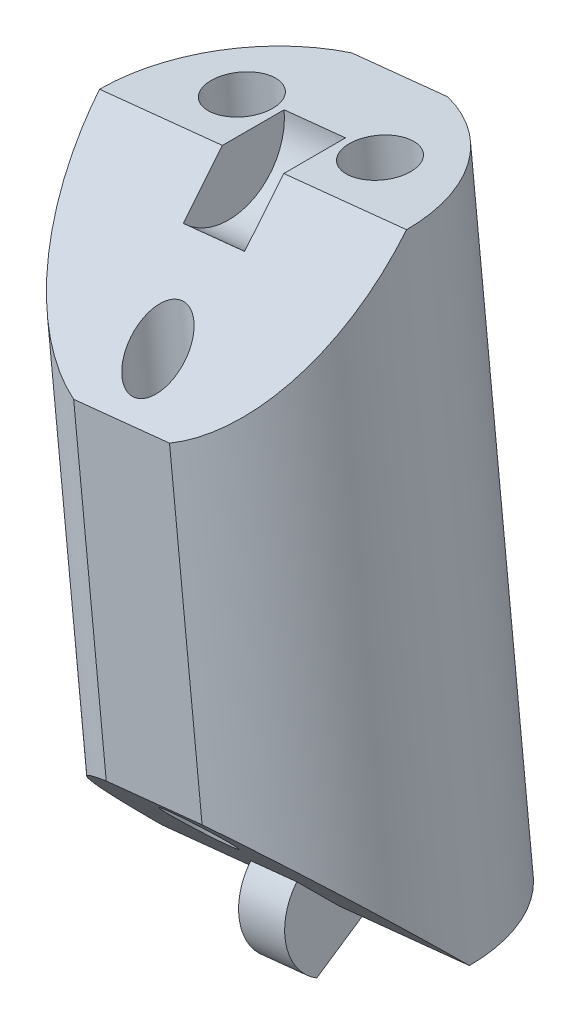
ISO-10303-21;
HEADER;
FILE_DESCRIPTION(('STEP AP214'),'2;1');
FILE_NAME('part.step','',(''),(''),'','','');
FILE_SCHEMA(('AUTOMOTIVE_DESIGN { 1 0 10303 214 1 1 1 1 }'));
ENDSEC;
DATA;
#1=APPLICATION_CONTEXT('core data for automotive mechanical design processes');
#2=APPLICATION_PROTOCOL_DEFINITION('international standard','automotive_design',2000,#1);
#3=PRODUCT_CONTEXT('',#1,'mechanical');
#4=PRODUCT('Part','Part','',(#3));
#5=PRODUCT_RELATED_PRODUCT_CATEGORY('part','',(#4));
#6=PRODUCT_DEFINITION_FORMATION('','',#4);
#7=PRODUCT_DEFINITION_CONTEXT('part definition',#1,'design');
#8=PRODUCT_DEFINITION('design','',#6,#7);
#9=PRODUCT_DEFINITION_SHAPE('','',#8);
#10=(LENGTH_UNIT() NAMED_UNIT(*) SI_UNIT(.MILLI.,.METRE.));
#11=(NAMED_UNIT(*) PLANE_ANGLE_UNIT() SI_UNIT($,.RADIAN.));
#12=(NAMED_UNIT(*) SI_UNIT($,.STERADIAN.) SOLID_ANGLE_UNIT());
#13=UNCERTAINTY_MEASURE_WITH_UNIT(LENGTH_MEASURE(1.E-05),#10,'distance_accuracy_value','');
#14=(GEOMETRIC_REPRESENTATION_CONTEXT(3) GLOBAL_UNCERTAINTY_ASSIGNED_CONTEXT((#13)) GLOBAL_UNIT_ASSIGNED_CONTEXT((#10,
#11,#12)) REPRESENTATION_CONTEXT('',''));
#15=CARTESIAN_POINT('',(0.,0.,0.));
#16=DIRECTION('',(0.,0.,1.));
#17=DIRECTION('',(1.,0.,0.));
#18=AXIS2_PLACEMENT_3D('',#15,#16,#17);
#19=CARTESIAN_POINT('',(-6.71132089996968,165.844299887328,0.));
#20=DIRECTION('',(-0.103150523023817,0.994665757729657,0.));
#21=DIRECTION('',(-0.994665757729657,-0.103150523023817,0.));
#22=AXIS2_PLACEMENT_3D('',#19,#20,#21);
#23=CYLINDRICAL_SURFACE('',#22,8.);
#24=CARTESIAN_POINT('',(-6.71132089996968,165.844299887328,0.));
#25=DIRECTION('',(0.103150523023817,-0.994665757729657,0.));
#26=DIRECTION('',(0.994665757729657,0.103150523023817,0.));
#27=AXIS2_PLACEMENT_3D('',#24,#25,#26);
#28=CIRCLE('',#27,8.);
#29=CARTESIAN_POINT('',(-4.22664663353082,166.101969811255,-7.6));
#30=VERTEX_POINT('',#29);
#31=CARTESIAN_POINT('',(1.24600516186757,166.669504071519,0.));
#32=VERTEX_POINT('',#31);
#33=EDGE_CURVE('E156',#30,#32,#28,.T.);
#34=ORIENTED_EDGE('',*,*,#33,.F.);
#35=DIRECTION('',(-0.103150523023817,0.994665757729657,0.));
#36=VECTOR('',#35,1.);
#37=CARTESIAN_POINT('',(-4.22664663353082,166.101969811255,-7.6));
#38=LINE('',#37,#36);
#39=CARTESIAN_POINT('',(-7.48403157112503,197.512467423771,-7.6));
#40=VERTEX_POINT('',#39);
#41=EDGE_CURVE('E11',#30,#40,#38,.T.);
#42=ORIENTED_EDGE('',*,*,#41,.T.);
#43=CARTESIAN_POINT('',(-9.9687058375639,197.254797499844,0.));
#44=DIRECTION('',(0.103150523023817,-0.994665757729657,0.));
#45=DIRECTION('',(0.994665757729657,0.103150523023817,0.));
#46=AXIS2_PLACEMENT_3D('',#43,#44,#45);
#47=CIRCLE('',#46,8.);
#48=CARTESIAN_POINT('',(-2.01137977572664,198.080001684034,0.));
#49=VERTEX_POINT('',#48);
#50=EDGE_CURVE('E148',#40,#49,#47,.T.);
#51=ORIENTED_EDGE('',*,*,#50,.T.);
#52=CARTESIAN_POINT('',(-9.9687058375639,197.254797499844,0.));
#53=DIRECTION('',(0.0729384343130803,-0.703334902304699,-0.707106781186544));
#54=DIRECTION('',(-0.0729384343130796,0.703334902304693,-0.707106781186551));
#55=AXIS2_PLACEMENT_3D('',#52,#53,#54);
#56=ELLIPSE('',#55,11.3137084989847,8.);
#57=CARTESIAN_POINT('',(-6.70008759614404,189.953007665026,7.6));
#58=VERTEX_POINT('',#57);
#59=EDGE_CURVE('E202',#49,#58,#56,.T.);
#60=ORIENTED_EDGE('',*,*,#59,.T.);
#61=DIRECTION('',(-0.103150523023817,0.994665757729657,0.));
#62=VECTOR('',#61,1.);
#63=CARTESIAN_POINT('',(-4.22664663353082,166.101969811255,7.6));
#64=LINE('',#63,#62);
#65=CARTESIAN_POINT('',(-5.01059060851183,173.661429570001,7.6));
#66=VERTEX_POINT('',#65);
#67=EDGE_CURVE('E174',#58,#66,#64,.F.);
#68=ORIENTED_EDGE('',*,*,#67,.T.);
#69=CARTESIAN_POINT('',(-6.71132089996969,165.844299887328,0.));
#70=DIRECTION('',(-0.0729384343130803,0.7033349023047,-0.707106781186543));
#71=DIRECTION('',(-0.0729384343130795,0.703334902304692,0.707106781186552));
#72=AXIS2_PLACEMENT_3D('',#69,#70,#71);
#73=ELLIPSE('',#72,11.3137084989847,8.);
#74=EDGE_CURVE('E207',#66,#32,#73,.T.);
#75=ORIENTED_EDGE('',*,*,#74,.T.);
#76=EDGE_LOOP('',(#34,#42,#51,#60,#68,#75));
#77=FACE_BOUND('',#76,.T.);
#78=ADVANCED_FACE('F39',(#77),#23,.T.);
#79=CARTESIAN_POINT('',(-9.9687058375639,197.254797499844,0.));
#80=DIRECTION('',(0.103150523023817,-0.994665757729657,0.));
#81=DIRECTION('',(0.994665757729657,0.103150523023817,0.));
#82=AXIS2_PLACEMENT_3D('',#79,#80,#81);
#83=PLANE('',#82);
#84=CARTESIAN_POINT('',(-13.5495025653907,196.883455616958,-3.));
#85=DIRECTION('',(0.103150523023817,-0.994665757729657,0.));
#86=DIRECTION('',(0.994665757729657,0.103150523023817,0.));
#87=AXIS2_PLACEMENT_3D('',#84,#85,#86);
#88=CIRCLE('',#87,1.6);
#89=CARTESIAN_POINT('',(-11.9580373530232,197.048496453796,-3.));
#90=VERTEX_POINT('',#89);
#91=EDGE_CURVE('E189',#90,#90,#88,.T.);
#92=ORIENTED_EDGE('',*,*,#91,.T.);
#93=EDGE_LOOP('',(#92));
#94=FACE_BOUND('',#93,.T.);
#95=CARTESIAN_POINT('',(-6.38790910973713,197.62613938273,-3.));
#96=DIRECTION('',(0.103150523023817,-0.994665757729657,0.));
#97=DIRECTION('',(0.994665757729657,0.103150523023817,0.));
#98=AXIS2_PLACEMENT_3D('',#95,#96,#97);
#99=CIRCLE('',#98,1.6);
#100=CARTESIAN_POINT('',(-4.79644389736968,197.791180219568,-3.));
#101=VERTEX_POINT('',#100);
#102=EDGE_CURVE('E184',#101,#101,#99,.T.);
#103=ORIENTED_EDGE('',*,*,#102,.T.);
#104=EDGE_LOOP('',(#103));
#105=FACE_BOUND('',#104,.T.);
#106=ORIENTED_EDGE('',*,*,#50,.F.);
#107=DIRECTION('',(0.994665757729657,0.103150523023816,0.));
#108=VECTOR('',#107,1.);
#109=CARTESIAN_POINT('',(-12.4533801040028,196.997127575917,-7.6));
#110=LINE('',#109,#108);
#111=CARTESIAN_POINT('',(-12.4533801040028,196.997127575917,-7.6));
#112=VERTEX_POINT('',#111);
#113=EDGE_CURVE('E134',#112,#40,#110,.T.);
#114=ORIENTED_EDGE('',*,*,#113,.F.);
#115=CARTESIAN_POINT('',(-17.9260318994012,196.429593315653,0.));
#116=VERTEX_POINT('',#115);
#117=EDGE_CURVE('E146',#116,#112,#47,.T.);
#118=ORIENTED_EDGE('',*,*,#117,.F.);
#119=DIRECTION('',(0.994665757729657,0.103150523023817,0.));
#120=VECTOR('',#119,1.);
#121=CARTESIAN_POINT('',(-9.9687058375639,197.254797499844,0.));
#122=LINE('',#121,#120);
#123=CARTESIAN_POINT('',(-11.5601710499314,197.089756663006,0.));
#124=VERTEX_POINT('',#123);
#125=EDGE_CURVE('E165',#116,#124,#122,.T.);
#126=ORIENTED_EDGE('',*,*,#125,.T.);
#127=DIRECTION('',(0.,0.,-1.));
#128=VECTOR('',#127,1.);
#129=CARTESIAN_POINT('',(-11.5601710499314,197.089756663006,0.));
#130=LINE('',#129,#128);
#131=CARTESIAN_POINT('',(-11.5601710499314,197.089756663006,-3.2));
#132=VERTEX_POINT('',#131);
#133=EDGE_CURVE('E256',#124,#132,#130,.T.);
#134=ORIENTED_EDGE('',*,*,#133,.T.);
#135=DIRECTION('',(-0.994665757729657,-0.103150523023817,0.));
#136=VECTOR('',#135,1.);
#137=CARTESIAN_POINT('',(-8.37724062519646,197.419838336682,-3.2));
#138=LINE('',#137,#136);
#139=CARTESIAN_POINT('',(-8.37724062519646,197.419838336682,-3.2));
#140=VERTEX_POINT('',#139);
#141=EDGE_CURVE('E269',#140,#132,#138,.T.);
#142=ORIENTED_EDGE('',*,*,#141,.F.);
#143=DIRECTION('',(0.,0.,-1.));
#144=VECTOR('',#143,1.);
#145=CARTESIAN_POINT('',(-8.37724062519647,197.419838336682,0.));
#146=LINE('',#145,#144);
#147=CARTESIAN_POINT('',(-8.37724062519647,197.419838336682,0.));
#148=VERTEX_POINT('',#147);
#149=EDGE_CURVE('E257',#148,#140,#146,.T.);
#150=ORIENTED_EDGE('',*,*,#149,.F.);
#151=EDGE_CURVE('E169',#148,#49,#122,.T.);
#152=ORIENTED_EDGE('',*,*,#151,.T.);
#153=EDGE_LOOP('',(#106,#114,#118,#126,#134,#142,#150,#152));
#154=FACE_BOUND('',#153,.T.);
#155=ADVANCED_FACE('F144',(#94,#105,#154),#83,.F.);
#156=CARTESIAN_POINT('',(1.21134648710678,198.414210333514,0.));
#157=DIRECTION('',(0.0729384343130803,-0.703334902304699,-0.707106781186544));
#158=DIRECTION('',(0.,0.708995228875745,-0.705213276556411));
#159=AXIS2_PLACEMENT_3D('',#156,#157,#158);
#160=PLANE('',#159);
#161=CARTESIAN_POINT('',(-9.40137796093291,191.784135832331,5.5));
#162=DIRECTION('',(0.0729384343130803,-0.703334902304699,-0.707106781186544));
#163=DIRECTION('',(-0.0729384343130797,0.703334902304693,-0.707106781186551));
#164=AXIS2_PLACEMENT_3D('',#161,#162,#163);
#165=ELLIPSE('',#164,1.97989898732232,1.4);
#166=CARTESIAN_POINT('',(-9.54578869316626,193.176667893152,4.1));
#167=VERTEX_POINT('',#166);
#168=EDGE_CURVE('E179',#167,#167,#165,.T.);
#169=ORIENTED_EDGE('',*,*,#168,.T.);
#170=EDGE_LOOP('',(#169));
#171=FACE_BOUND('',#170,.T.);
#172=CARTESIAN_POINT('',(-11.6694361290218,189.437667817172,7.6));
#173=VERTEX_POINT('',#172);
#174=EDGE_CURVE('E153',#173,#116,#56,.T.);
#175=ORIENTED_EDGE('',*,*,#174,.F.);
#176=DIRECTION('',(0.994665757729657,0.103150523023817,0.));
#177=VECTOR('',#176,1.);
#178=CARTESIAN_POINT('',(1.99529046208778,190.854750574768,7.6));
#179=LINE('',#178,#177);
#180=EDGE_CURVE('E198',#173,#58,#179,.T.);
#181=ORIENTED_EDGE('',*,*,#180,.T.);
#182=ORIENTED_EDGE('',*,*,#59,.F.);
#183=ORIENTED_EDGE('',*,*,#151,.F.);
#184=DIRECTION('',(-0.0729384343130776,0.703334902304677,-0.707106781186567));
#185=VECTOR('',#184,1.);
#186=CARTESIAN_POINT('',(-8.14383763539462,195.169166649307,2.26274169979702));
#187=LINE('',#186,#185);
#188=CARTESIAN_POINT('',(-8.14383763539462,195.169166649307,2.26274169979702));
#189=VERTEX_POINT('',#188);
#190=EDGE_CURVE('E266',#189,#148,#187,.T.);
#191=ORIENTED_EDGE('',*,*,#190,.F.);
#192=DIRECTION('',(-0.994665757729657,-0.103150523023817,0.));
#193=VECTOR('',#192,1.);
#194=CARTESIAN_POINT('',(-8.14383763539462,195.169166649307,2.26274169979702));
#195=LINE('',#194,#193);
#196=CARTESIAN_POINT('',(-11.3267680601295,194.839084975631,2.26274169979702));
#197=VERTEX_POINT('',#196);
#198=EDGE_CURVE('E278',#189,#197,#195,.T.);
#199=ORIENTED_EDGE('',*,*,#198,.T.);
#200=DIRECTION('',(-0.0729384343130776,0.703334902304677,-0.707106781186567));
#201=VECTOR('',#200,1.);
#202=CARTESIAN_POINT('',(-11.3267680601295,194.839084975631,2.26274169979702));
#203=LINE('',#202,#201);
#204=EDGE_CURVE('E262',#197,#124,#203,.T.);
#205=ORIENTED_EDGE('',*,*,#204,.T.);
#206=ORIENTED_EDGE('',*,*,#125,.F.);
#207=EDGE_LOOP('',(#175,#181,#182,#183,#191,#199,#205,#206));
#208=FACE_BOUND('',#207,.T.);
#209=ADVANCED_FACE('F196',(#171,#208),#160,.F.);
#210=CARTESIAN_POINT('',(-6.71132089996968,165.844299887328,0.));
#211=DIRECTION('',(0.103150523023817,-0.994665757729657,0.));
#212=DIRECTION('',(0.994665757729657,0.103150523023817,0.));
#213=AXIS2_PLACEMENT_3D('',#210,#211,#212);
#214=PLANE('',#213);
#215=DIRECTION('',(-0.994665757729657,-0.103150523023817,0.));
#216=VECTOR('',#215,1.);
#217=CARTESIAN_POINT('',(-6.71132089996968,165.844299887328,-7.6));
#218=LINE('',#217,#216);
#219=CARTESIAN_POINT('',(-9.19599516640854,165.586629963401,-7.6));
#220=VERTEX_POINT('',#219);
#221=EDGE_CURVE('E55',#30,#220,#218,.T.);
#222=ORIENTED_EDGE('',*,*,#221,.F.);
#223=ORIENTED_EDGE('',*,*,#33,.T.);
#224=DIRECTION('',(0.994665757729657,0.103150523023817,0.));
#225=VECTOR('',#224,1.);
#226=CARTESIAN_POINT('',(-6.71132089996968,165.844299887328,0.));
#227=LINE('',#226,#225);
#228=CARTESIAN_POINT('',(-5.5177219906941,165.968080514957,0.));
#229=VERTEX_POINT('',#228);
#230=EDGE_CURVE('E168',#229,#32,#227,.T.);
#231=ORIENTED_EDGE('',*,*,#230,.F.);
#232=DIRECTION('',(0.,0.,-1.));
#233=VECTOR('',#232,1.);
#234=CARTESIAN_POINT('',(-5.51772199069411,165.968080514957,0.));
#235=LINE('',#234,#233);
#236=CARTESIAN_POINT('',(-5.51772199069411,165.968080514957,-2.8));
#237=VERTEX_POINT('',#236);
#238=EDGE_CURVE('E282',#229,#237,#235,.T.);
#239=ORIENTED_EDGE('',*,*,#238,.T.);
#240=DIRECTION('',(0.994665757729657,0.103150523023817,0.));
#241=VECTOR('',#240,1.);
#242=CARTESIAN_POINT('',(-7.90491980924529,165.7205192597,-2.8));
#243=LINE('',#242,#241);
#244=CARTESIAN_POINT('',(-7.90491980924529,165.7205192597,-2.8));
#245=VERTEX_POINT('',#244);
#246=EDGE_CURVE('E203',#245,#237,#243,.T.);
#247=ORIENTED_EDGE('',*,*,#246,.F.);
#248=DIRECTION('',(0.,0.,-1.));
#249=VECTOR('',#248,1.);
#250=CARTESIAN_POINT('',(-7.90491980924529,165.7205192597,0.));
#251=LINE('',#250,#249);
#252=CARTESIAN_POINT('',(-7.90491980924529,165.7205192597,0.));
#253=VERTEX_POINT('',#252);
#254=EDGE_CURVE('E237',#253,#245,#251,.T.);
#255=ORIENTED_EDGE('',*,*,#254,.F.);
#256=CARTESIAN_POINT('',(-14.6686469618069,165.019095703138,0.));
#257=VERTEX_POINT('',#256);
#258=EDGE_CURVE('E170',#257,#253,#227,.T.);
#259=ORIENTED_EDGE('',*,*,#258,.F.);
#260=EDGE_CURVE('E160',#257,#220,#28,.T.);
#261=ORIENTED_EDGE('',*,*,#260,.T.);
#262=EDGE_LOOP('',(#222,#223,#231,#239,#247,#255,#259,#261));
#263=FACE_BOUND('',#262,.T.);
#264=CARTESIAN_POINT('',(-10.2921176277964,165.472958004443,-3.));
#265=DIRECTION('',(0.103150523023817,-0.994665757729657,0.));
#266=DIRECTION('',(0.994665757729657,0.103150523023817,0.));
#267=AXIS2_PLACEMENT_3D('',#264,#265,#266);
#268=CIRCLE('',#267,1.6);
#269=CARTESIAN_POINT('',(-8.700652415429,165.637998841281,-3.));
#270=VERTEX_POINT('',#269);
#271=EDGE_CURVE('E185',#270,#270,#268,.T.);
#272=ORIENTED_EDGE('',*,*,#271,.F.);
#273=EDGE_LOOP('',(#272));
#274=FACE_BOUND('',#273,.T.);
#275=CARTESIAN_POINT('',(-3.13052417214292,166.215641770214,-3.));
#276=DIRECTION('',(0.103150523023817,-0.994665757729657,0.));
#277=DIRECTION('',(0.994665757729657,0.103150523023817,0.));
#278=AXIS2_PLACEMENT_3D('',#275,#276,#277);
#279=CIRCLE('',#278,1.6);
#280=CARTESIAN_POINT('',(-1.53905895977547,166.380682607052,-3.));
#281=VERTEX_POINT('',#280);
#282=EDGE_CURVE('E180',#281,#281,#279,.T.);
#283=ORIENTED_EDGE('',*,*,#282,.F.);
#284=EDGE_LOOP('',(#283));
#285=FACE_BOUND('',#284,.T.);
#286=ADVANCED_FACE('F232',(#263,#274,#285),#214,.T.);
#287=CARTESIAN_POINT('',(4.468731424701,167.003712720998,0.));
#288=DIRECTION('',(-0.0729384343130803,0.7033349023047,-0.707106781186543));
#289=DIRECTION('',(0.,0.708995228875744,0.705213276556412));
#290=AXIS2_PLACEMENT_3D('',#287,#288,#289);
#291=PLANE('',#290);
#292=CARTESIAN_POINT('',(-7.27864877660067,171.314961554842,5.5));
#293=DIRECTION('',(-0.0729384343130803,0.7033349023047,-0.707106781186543));
#294=DIRECTION('',(-0.0729384343130795,0.703334902304692,0.707106781186552));
#295=AXIS2_PLACEMENT_3D('',#292,#293,#294);
#296=ELLIPSE('',#295,1.97989898732232,1.4);
#297=CARTESIAN_POINT('',(-7.42305950883401,172.707493615663,6.9));
#298=VERTEX_POINT('',#297);
#299=EDGE_CURVE('E175',#298,#298,#296,.T.);
#300=ORIENTED_EDGE('',*,*,#299,.T.);
#301=EDGE_LOOP('',(#300));
#302=FACE_BOUND('',#301,.T.);
#303=ORIENTED_EDGE('',*,*,#74,.F.);
#304=DIRECTION('',(-0.994665757729657,-0.103150523023817,0.));
#305=VECTOR('',#304,1.);
#306=CARTESIAN_POINT('',(3.68478744972,174.563172479743,7.6));
#307=LINE('',#306,#305);
#308=CARTESIAN_POINT('',(-9.97993914138955,173.146089722147,7.6));
#309=VERTEX_POINT('',#308);
#310=EDGE_CURVE('E63',#66,#309,#307,.T.);
#311=ORIENTED_EDGE('',*,*,#310,.T.);
#312=EDGE_CURVE('E162',#257,#309,#73,.T.);
#313=ORIENTED_EDGE('',*,*,#312,.F.);
#314=ORIENTED_EDGE('',*,*,#258,.T.);
#315=DIRECTION('',(0.0729384343130817,-0.703334902304702,-0.707106781186541));
#316=VECTOR('',#315,1.);
#317=CARTESIAN_POINT('',(-8.10914742532191,167.689856986153,1.97989898732231));
#318=LINE('',#317,#316);
#319=CARTESIAN_POINT('',(-8.10914742532191,167.689856986153,1.97989898732231));
#320=VERTEX_POINT('',#319);
#321=EDGE_CURVE('E239',#320,#253,#318,.T.);
#322=ORIENTED_EDGE('',*,*,#321,.F.);
#323=DIRECTION('',(0.994665757729657,0.103150523023817,0.));
#324=VECTOR('',#323,1.);
#325=CARTESIAN_POINT('',(-8.10914742532191,167.689856986153,1.97989898732231));
#326=LINE('',#325,#324);
#327=CARTESIAN_POINT('',(-5.72194960677074,167.93741824141,1.97989898732231));
#328=VERTEX_POINT('',#327);
#329=EDGE_CURVE('E295',#320,#328,#326,.T.);
#330=ORIENTED_EDGE('',*,*,#329,.T.);
#331=DIRECTION('',(0.0729384343130817,-0.703334902304702,-0.707106781186541));
#332=VECTOR('',#331,1.);
#333=CARTESIAN_POINT('',(-5.72194960677074,167.93741824141,1.97989898732231));
#334=LINE('',#333,#332);
#335=EDGE_CURVE('E225',#328,#229,#334,.T.);
#336=ORIENTED_EDGE('',*,*,#335,.T.);
#337=ORIENTED_EDGE('',*,*,#230,.T.);
#338=EDGE_LOOP('',(#303,#311,#313,#314,#322,#330,#336,#337));
#339=FACE_BOUND('',#338,.T.);
#340=ADVANCED_FACE('F222',(#302,#339),#291,.F.);
#341=ORIENTED_EDGE('',*,*,#117,.T.);
#342=DIRECTION('',(-0.103150523023817,0.994665757729657,0.));
#343=VECTOR('',#342,1.);
#344=CARTESIAN_POINT('',(-9.19599516640854,165.586629963401,-7.6));
#345=LINE('',#344,#343);
#346=EDGE_CURVE('E48',#112,#220,#345,.F.);
#347=ORIENTED_EDGE('',*,*,#346,.T.);
#348=ORIENTED_EDGE('',*,*,#260,.F.);
#349=ORIENTED_EDGE('',*,*,#312,.T.);
#350=DIRECTION('',(-0.103150523023817,0.994665757729657,0.));
#351=VECTOR('',#350,1.);
#352=CARTESIAN_POINT('',(-9.19599516640854,165.586629963401,7.6));
#353=LINE('',#352,#351);
#354=EDGE_CURVE('E140',#309,#173,#353,.T.);
#355=ORIENTED_EDGE('',*,*,#354,.T.);
#356=ORIENTED_EDGE('',*,*,#174,.T.);
#357=EDGE_LOOP('',(#341,#347,#348,#349,#355,#356));
#358=FACE_BOUND('',#357,.T.);
#359=ADVANCED_FACE('F41',(#358),#23,.T.);
#360=CARTESIAN_POINT('',(-7.90491980924529,165.7205192597,-2.8));
#361=DIRECTION('',(-0.0893309733522766,0.861405814468378,0.500000000000006));
#362=DIRECTION('',(0.,-0.502007025803869,0.86486354186285));
#363=AXIS2_PLACEMENT_3D('',#360,#361,#362);
#364=PLANE('',#363);
#365=DIRECTION('',(0.0515752615119082,-0.497332878864834,0.866025403784435));
#366=VECTOR('',#365,1.);
#367=CARTESIAN_POINT('',(-5.51772199069411,165.968080514957,-2.8));
#368=LINE('',#367,#366);
#369=CARTESIAN_POINT('',(-5.26759526530773,163.556144234446,1.4));
#370=VERTEX_POINT('',#369);
#371=EDGE_CURVE('E298',#237,#370,#368,.T.);
#372=ORIENTED_EDGE('',*,*,#371,.T.);
#373=DIRECTION('',(0.994665757729657,0.103150523023817,0.));
#374=VECTOR('',#373,1.);
#375=CARTESIAN_POINT('',(-7.65479308385891,163.308582979188,1.4));
#376=LINE('',#375,#374);
#377=CARTESIAN_POINT('',(-7.65479308385891,163.308582979188,1.4));
#378=VERTEX_POINT('',#377);
#379=EDGE_CURVE('E209',#378,#370,#376,.T.);
#380=ORIENTED_EDGE('',*,*,#379,.F.);
#381=DIRECTION('',(0.0515752615119082,-0.497332878864834,0.866025403784435));
#382=VECTOR('',#381,1.);
#383=CARTESIAN_POINT('',(-7.90491980924529,165.7205192597,-2.8));
#384=LINE('',#383,#382);
#385=EDGE_CURVE('E287',#245,#378,#384,.T.);
#386=ORIENTED_EDGE('',*,*,#385,.F.);
#387=ORIENTED_EDGE('',*,*,#246,.T.);
#388=EDGE_LOOP('',(#372,#380,#386,#387));
#389=FACE_BOUND('',#388,.T.);
#390=ADVANCED_FACE('F318',(#389),#364,.F.);
#391=CARTESIAN_POINT('',(-7.90491980924529,165.7205192597,0.));
#392=DIRECTION('',(0.994665757729657,0.103150523023817,0.));
#393=DIRECTION('',(-0.103150523023817,0.994665757729657,0.));
#394=AXIS2_PLACEMENT_3D('',#391,#392,#393);
#395=CYLINDRICAL_SURFACE('',#394,2.80000000000002);
#396=CARTESIAN_POINT('',(-5.51772199069411,165.968080514957,0.));
#397=DIRECTION('',(-0.994665757729657,-0.103150523023817,0.));
#398=DIRECTION('',(-0.103150523023817,0.994665757729657,0.));
#399=AXIS2_PLACEMENT_3D('',#396,#397,#398);
#400=CIRCLE('',#399,2.80000000000002);
#401=EDGE_CURVE('E301',#370,#328,#400,.T.);
#402=ORIENTED_EDGE('',*,*,#401,.T.);
#403=ORIENTED_EDGE('',*,*,#329,.F.);
#404=CARTESIAN_POINT('',(-7.90491980924529,165.7205192597,0.));
#405=DIRECTION('',(-0.994665757729657,-0.103150523023817,0.));
#406=DIRECTION('',(-0.103150523023817,0.994665757729657,0.));
#407=AXIS2_PLACEMENT_3D('',#404,#405,#406);
#408=CIRCLE('',#407,2.80000000000002);
#409=EDGE_CURVE('E290',#378,#320,#408,.T.);
#410=ORIENTED_EDGE('',*,*,#409,.F.);
#411=ORIENTED_EDGE('',*,*,#379,.T.);
#412=EDGE_LOOP('',(#402,#403,#410,#411));
#413=FACE_BOUND('',#412,.T.);
#414=ADVANCED_FACE('F313',(#413),#395,.T.);
#415=CARTESIAN_POINT('',(-7.90491980924529,165.7205192597,0.));
#416=DIRECTION('',(0.994665757729657,0.103150523023817,0.));
#417=DIRECTION('',(-0.103150523023817,0.994665757729657,0.));
#418=AXIS2_PLACEMENT_3D('',#415,#416,#417);
#419=PLANE('',#418);
#420=ORIENTED_EDGE('',*,*,#254,.T.);
#421=ORIENTED_EDGE('',*,*,#385,.T.);
#422=ORIENTED_EDGE('',*,*,#409,.T.);
#423=ORIENTED_EDGE('',*,*,#321,.T.);
#424=EDGE_LOOP('',(#420,#421,#422,#423));
#425=FACE_BOUND('',#424,.T.);
#426=ADVANCED_FACE('F320',(#425),#419,.F.);
#427=CARTESIAN_POINT('',(-5.51772199069411,165.968080514957,0.));
#428=DIRECTION('',(0.994665757729657,0.103150523023817,0.));
#429=DIRECTION('',(-0.103150523023817,0.994665757729657,0.));
#430=AXIS2_PLACEMENT_3D('',#427,#428,#429);
#431=PLANE('',#430);
#432=ORIENTED_EDGE('',*,*,#238,.F.);
#433=ORIENTED_EDGE('',*,*,#335,.F.);
#434=ORIENTED_EDGE('',*,*,#401,.F.);
#435=ORIENTED_EDGE('',*,*,#371,.F.);
#436=EDGE_LOOP('',(#432,#433,#434,#435));
#437=FACE_BOUND('',#436,.T.);
#438=ADVANCED_FACE('F317',(#437),#431,.T.);
#439=CARTESIAN_POINT('',(-8.37724062519647,197.419838336682,0.));
#440=DIRECTION('',(-0.994665757729657,-0.103150523023817,0.));
#441=DIRECTION('',(0.103150523023817,-0.994665757729657,0.));
#442=AXIS2_PLACEMENT_3D('',#439,#440,#441);
#443=CYLINDRICAL_SURFACE('',#442,3.2);
#444=CARTESIAN_POINT('',(-11.5601710499314,197.089756663006,0.));
#445=DIRECTION('',(-0.994665757729657,-0.103150523023817,0.));
#446=DIRECTION('',(0.103150523023817,-0.994665757729657,0.));
#447=AXIS2_PLACEMENT_3D('',#444,#445,#446);
#448=CIRCLE('',#447,3.2);
#449=EDGE_CURVE('E273',#132,#197,#448,.T.);
#450=ORIENTED_EDGE('',*,*,#449,.T.);
#451=ORIENTED_EDGE('',*,*,#198,.F.);
#452=CARTESIAN_POINT('',(-8.37724062519647,197.419838336682,0.));
#453=DIRECTION('',(-0.994665757729657,-0.103150523023817,0.));
#454=DIRECTION('',(0.103150523023817,-0.994665757729657,0.));
#455=AXIS2_PLACEMENT_3D('',#452,#453,#454);
#456=CIRCLE('',#455,3.2);
#457=EDGE_CURVE('E261',#140,#189,#456,.T.);
#458=ORIENTED_EDGE('',*,*,#457,.F.);
#459=ORIENTED_EDGE('',*,*,#141,.T.);
#460=EDGE_LOOP('',(#450,#451,#458,#459));
#461=FACE_BOUND('',#460,.T.);
#462=ADVANCED_FACE('F327',(#461),#443,.F.);
#463=CARTESIAN_POINT('',(-8.37724062519647,197.419838336682,0.));
#464=DIRECTION('',(-0.994665757729657,-0.103150523023817,0.));
#465=DIRECTION('',(0.103150523023817,-0.994665757729657,0.));
#466=AXIS2_PLACEMENT_3D('',#463,#464,#465);
#467=PLANE('',#466);
#468=ORIENTED_EDGE('',*,*,#149,.T.);
#469=ORIENTED_EDGE('',*,*,#457,.T.);
#470=ORIENTED_EDGE('',*,*,#190,.T.);
#471=EDGE_LOOP('',(#468,#469,#470));
#472=FACE_BOUND('',#471,.T.);
#473=ADVANCED_FACE('F368',(#472),#467,.T.);
#474=CARTESIAN_POINT('',(-11.5601710499314,197.089756663006,0.));
#475=DIRECTION('',(-0.994665757729657,-0.103150523023817,0.));
#476=DIRECTION('',(0.103150523023817,-0.994665757729657,0.));
#477=AXIS2_PLACEMENT_3D('',#474,#475,#476);
#478=PLANE('',#477);
#479=ORIENTED_EDGE('',*,*,#133,.F.);
#480=ORIENTED_EDGE('',*,*,#204,.F.);
#481=ORIENTED_EDGE('',*,*,#449,.F.);
#482=EDGE_LOOP('',(#479,#480,#481));
#483=FACE_BOUND('',#482,.T.);
#484=ADVANCED_FACE('F358',(#483),#478,.F.);
#485=CARTESIAN_POINT('',(-6.36648941066374,162.519139097593,5.5));
#486=DIRECTION('',(-0.103150523023817,0.994665757729657,0.));
#487=DIRECTION('',(-0.994665757729657,-0.103150523023817,0.));
#488=AXIS2_PLACEMENT_3D('',#485,#486,#487);
#489=CYLINDRICAL_SURFACE('',#488,1.4);
#490=ORIENTED_EDGE('',*,*,#299,.F.);
#491=EDGE_LOOP('',(#490));
#492=FACE_BOUND('',#491,.T.);
#493=ORIENTED_EDGE('',*,*,#168,.F.);
#494=EDGE_LOOP('',(#493));
#495=FACE_BOUND('',#494,.T.);
#496=ADVANCED_FACE('F355',(#492,#495),#489,.F.);
#497=CARTESIAN_POINT('',(-2.78569268283698,162.890480980478,-3.));
#498=DIRECTION('',(-0.103150523023817,0.994665757729657,0.));
#499=DIRECTION('',(-0.994665757729657,-0.103150523023817,0.));
#500=AXIS2_PLACEMENT_3D('',#497,#498,#499);
#501=CYLINDRICAL_SURFACE('',#500,1.6);
#502=ORIENTED_EDGE('',*,*,#282,.T.);
#503=EDGE_LOOP('',(#502));
#504=FACE_BOUND('',#503,.T.);
#505=ORIENTED_EDGE('',*,*,#102,.F.);
#506=EDGE_LOOP('',(#505));
#507=FACE_BOUND('',#506,.T.);
#508=ADVANCED_FACE('F357',(#504,#507),#501,.F.);
#509=CARTESIAN_POINT('',(-9.94728613849051,162.147797214707,-3.));
#510=DIRECTION('',(-0.103150523023817,0.994665757729657,0.));
#511=DIRECTION('',(-0.994665757729657,-0.103150523023817,0.));
#512=AXIS2_PLACEMENT_3D('',#509,#510,#511);
#513=CYLINDRICAL_SURFACE('',#512,1.6);
#514=ORIENTED_EDGE('',*,*,#271,.T.);
#515=EDGE_LOOP('',(#514));
#516=FACE_BOUND('',#515,.T.);
#517=ORIENTED_EDGE('',*,*,#91,.F.);
#518=EDGE_LOOP('',(#517));
#519=FACE_BOUND('',#518,.T.);
#520=ADVANCED_FACE('F365',(#516,#519),#513,.F.);
#521=CARTESIAN_POINT('',(-8.85116367710261,162.261469173666,7.6));
#522=DIRECTION('',(0.,0.,-1.));
#523=DIRECTION('',(-1.,0.,0.));
#524=AXIS2_PLACEMENT_3D('',#521,#522,#523);
#525=PLANE('',#524);
#526=ORIENTED_EDGE('',*,*,#354,.F.);
#527=ORIENTED_EDGE('',*,*,#310,.F.);
#528=ORIENTED_EDGE('',*,*,#67,.F.);
#529=ORIENTED_EDGE('',*,*,#180,.F.);
#530=EDGE_LOOP('',(#526,#527,#528,#529));
#531=FACE_BOUND('',#530,.T.);
#532=ADVANCED_FACE('F374',(#531),#525,.F.);
#533=CARTESIAN_POINT('',(-8.85116367710261,162.261469173666,-7.6));
#534=DIRECTION('',(0.,0.,1.));
#535=DIRECTION('',(1.,0.,0.));
#536=AXIS2_PLACEMENT_3D('',#533,#534,#535);
#537=PLANE('',#536);
#538=ORIENTED_EDGE('',*,*,#221,.T.);
#539=ORIENTED_EDGE('',*,*,#346,.F.);
#540=ORIENTED_EDGE('',*,*,#113,.T.);
#541=ORIENTED_EDGE('',*,*,#41,.F.);
#542=EDGE_LOOP('',(#538,#539,#540,#541));
#543=FACE_BOUND('',#542,.T.);
#544=ADVANCED_FACE('F133',(#543),#537,.F.);
#545=CLOSED_SHELL('',(#78,#155,#209,#286,#340,#359,#390,#414,#426,#438,#462,#473,#484,#496,#508,
#520,#532,#544));
#546=MANIFOLD_SOLID_BREP('B2',#545);
#547=ADVANCED_BREP_SHAPE_REPRESENTATION('',(#18,#546),#14);
#548=SHAPE_DEFINITION_REPRESENTATION(#9,#547);
ENDSEC;
END-ISO-10303-21;
